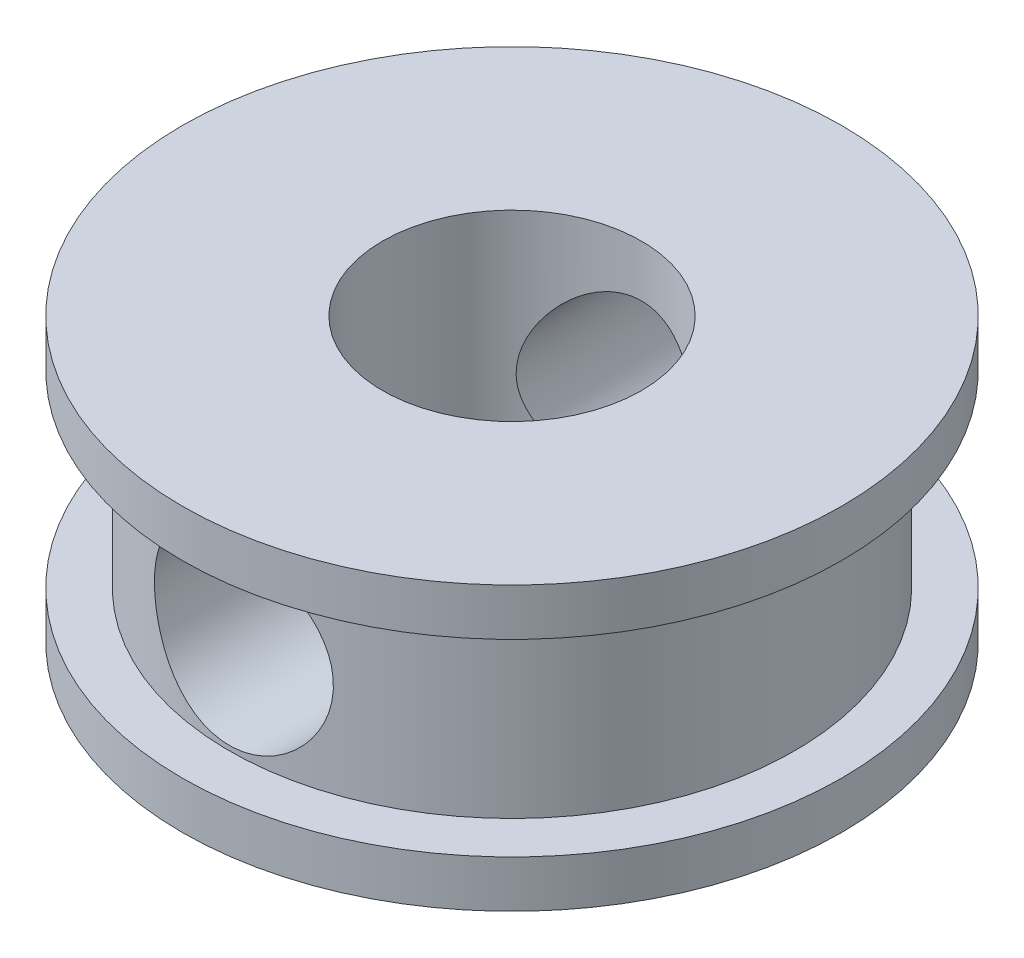
ISO-10303-21;
HEADER;
FILE_DESCRIPTION(('STEP AP214'),'2;1');
FILE_NAME('part.step','',(''),(''),'','','');
FILE_SCHEMA(('AUTOMOTIVE_DESIGN { 1 0 10303 214 1 1 1 1 }'));
ENDSEC;
DATA;
#1=APPLICATION_CONTEXT('core data for automotive mechanical design processes');
#2=APPLICATION_PROTOCOL_DEFINITION('international standard','automotive_design',2000,#1);
#3=PRODUCT_CONTEXT('',#1,'mechanical');
#4=PRODUCT('Part','Part','',(#3));
#5=PRODUCT_RELATED_PRODUCT_CATEGORY('part','',(#4));
#6=PRODUCT_DEFINITION_FORMATION('','',#4);
#7=PRODUCT_DEFINITION_CONTEXT('part definition',#1,'design');
#8=PRODUCT_DEFINITION('design','',#6,#7);
#9=PRODUCT_DEFINITION_SHAPE('','',#8);
#10=(LENGTH_UNIT() NAMED_UNIT(*) SI_UNIT(.MILLI.,.METRE.));
#11=(NAMED_UNIT(*) PLANE_ANGLE_UNIT() SI_UNIT($,.RADIAN.));
#12=(NAMED_UNIT(*) SI_UNIT($,.STERADIAN.) SOLID_ANGLE_UNIT());
#13=UNCERTAINTY_MEASURE_WITH_UNIT(LENGTH_MEASURE(1.E-05),#10,'distance_accuracy_value','');
#14=(GEOMETRIC_REPRESENTATION_CONTEXT(3) GLOBAL_UNCERTAINTY_ASSIGNED_CONTEXT((#13)) GLOBAL_UNIT_ASSIGNED_CONTEXT((#10,
#11,#12)) REPRESENTATION_CONTEXT('',''));
#15=CARTESIAN_POINT('',(0.,0.,0.));
#16=DIRECTION('',(0.,0.,1.));
#17=DIRECTION('',(1.,0.,0.));
#18=AXIS2_PLACEMENT_3D('',#15,#16,#17);
#19=CARTESIAN_POINT('',(0.,0.263948497845831,7.));
#20=DIRECTION('',(0.,0.,-1.));
#21=DIRECTION('',(-1.,0.,0.));
#22=AXIS2_PLACEMENT_3D('',#19,#20,#21);
#23=CYLINDRICAL_SURFACE('',#22,1.9);
#24=CARTESIAN_POINT('',(-1.9,0.263948497845831,1.9880895352071));
#25=CARTESIAN_POINT('',(-1.89999404447335,0.172327274623304,1.9881007358091));
#26=CARTESIAN_POINT('',(-1.89331043095478,0.0806676956721706,1.99454851919246));
#27=CARTESIAN_POINT('',(-1.86718454433567,-0.0992848520991401,2.01901316827147));
#28=CARTESIAN_POINT('',(-1.8477148194555,-0.187570143778473,2.03705492443201));
#29=CARTESIAN_POINT('',(-1.79764822395918,-0.357532810370994,2.08135844670453));
#30=CARTESIAN_POINT('',(-1.76717168893409,-0.43927039161618,2.10753090427701));
#31=CARTESIAN_POINT('',(-1.69629004962271,-0.596300804667676,2.1649897551614));
#32=CARTESIAN_POINT('',(-1.65588380386001,-0.67159289418559,2.19627673627818));
#33=CARTESIAN_POINT('',(-1.55833534939751,-0.8275776033711,2.26678073800009));
#34=CARTESIAN_POINT('',(-1.49951705098337,-0.907020956619099,2.30644281847351));
#35=CARTESIAN_POINT('',(-1.3701912373373,-1.05602049565281,2.38554763008912));
#36=CARTESIAN_POINT('',(-1.29966993909942,-1.12556484148201,2.42499004523128));
#37=CARTESIAN_POINT('',(-1.1353428696475,-1.26389410793194,2.50663206416706));
#38=CARTESIAN_POINT('',(-1.03961668156345,-1.33076898774464,2.5482595773733));
#39=CARTESIAN_POINT('',(-0.834873886026067,-1.44682722920803,2.62245462488903));
#40=CARTESIAN_POINT('',(-0.725883584681896,-1.49604486793004,2.6550396846641));
#41=CARTESIAN_POINT('',(-0.527893576818452,-1.56340241200277,2.70023568538219));
#42=CARTESIAN_POINT('',(-0.441189716547137,-1.58631344875936,2.7158470473333));
#43=CARTESIAN_POINT('',(-0.264362199220955,-1.61971463830576,2.7387103619111));
#44=CARTESIAN_POINT('',(-0.174241287405689,-1.63021455269059,2.74596888409369));
#45=CARTESIAN_POINT('',(0.0070210861693405,-1.63820738400496,2.751488477009));
#46=CARTESIAN_POINT('',(0.0981641135163359,-1.6356764669934,2.74973306088341));
#47=CARTESIAN_POINT('',(0.278558099739324,-1.61770679361148,2.7373499872899));
#48=CARTESIAN_POINT('',(0.367808510628421,-1.60226434978799,2.72671979524152));
#49=CARTESIAN_POINT('',(0.540131500294353,-1.55977741856117,2.69782146601909));
#50=CARTESIAN_POINT('',(0.623294108849536,-1.53298165238458,2.67971727076547));
#51=CARTESIAN_POINT('',(0.783781504366972,-1.46901344969137,2.63724974270066));
#52=CARTESIAN_POINT('',(0.86110516079632,-1.4318390101764,2.61288520176677));
#53=CARTESIAN_POINT('',(1.01716281444061,-1.34362612434644,2.55646556742752));
#54=CARTESIAN_POINT('',(1.09507632312398,-1.29149828595894,2.52385357819457));
#55=CARTESIAN_POINT('',(1.24155566131306,-1.17729472540619,2.45511729918543));
#56=CARTESIAN_POINT('',(1.31011092676434,-1.11520793018117,2.41898911765389));
#57=CARTESIAN_POINT('',(1.44839673133206,-0.970493560750748,2.33924544353163));
#58=CARTESIAN_POINT('',(1.51624231647591,-0.88617230437207,2.29542409356357));
#59=CARTESIAN_POINT('',(1.63724529668559,-0.706193862777931,2.21074011560224));
#60=CARTESIAN_POINT('',(1.69040834726466,-0.610541062663486,2.16987635287474));
#61=CARTESIAN_POINT('',(1.76980335263511,-0.432425229945425,2.1052975649513));
#62=CARTESIAN_POINT('',(1.79942712896406,-0.352128044040473,2.07980819780315));
#63=CARTESIAN_POINT('',(1.8478841504136,-0.186333490911925,2.03687984217778));
#64=CARTESIAN_POINT('',(1.86673748526285,-0.100846136558163,2.01942587743323));
#65=CARTESIAN_POINT('',(1.89259780209309,0.0743078260328144,1.9952221287981));
#66=CARTESIAN_POINT('',(1.89949339359139,0.164005820133362,1.98857303154539));
#67=CARTESIAN_POINT('',(1.90045206396883,0.343531373357523,1.98765816377183));
#68=CARTESIAN_POINT('',(1.8945175097829,0.433358905528485,1.99339010916744));
#69=CARTESIAN_POINT('',(1.87192998217414,0.598517087583221,2.01458751496171));
#70=CARTESIAN_POINT('',(1.85673916299946,0.674236461630931,2.02871961228108));
#71=CARTESIAN_POINT('',(1.81784749779855,0.82186138459038,2.06364069553949));
#72=CARTESIAN_POINT('',(1.79413821718417,0.893763072126628,2.08443627713857));
#73=CARTESIAN_POINT('',(1.72623582969987,1.06528008403537,2.14134557276662));
#74=CARTESIAN_POINT('',(1.67764251638548,1.1622801658443,2.18009028368248));
#75=CARTESIAN_POINT('',(1.56579729890002,1.34554063472735,2.26176723458626));
#76=CARTESIAN_POINT('',(1.50251731547395,1.43177995654507,2.30470740358499));
#77=CARTESIAN_POINT('',(1.36118267936232,1.59396114644787,2.39095276469785));
#78=CARTESIAN_POINT('',(1.28289947395058,1.66970755347376,2.4342521222988));
#79=CARTESIAN_POINT('',(1.11318361160209,1.80755987271563,2.51638277840081));
#80=CARTESIAN_POINT('',(1.02177126419677,1.86968648520253,2.55522081413946));
#81=CARTESIAN_POINT('',(0.84351761005188,1.96895815816514,2.6188489031262));
#82=CARTESIAN_POINT('',(0.758493921265446,2.00854752329301,2.64490306203371));
#83=CARTESIAN_POINT('',(0.581742290843918,2.07515696390105,2.68930418185455));
#84=CARTESIAN_POINT('',(0.490018578065371,2.10218488980771,2.70765595577135));
#85=CARTESIAN_POINT('',(0.301661107366574,2.14232931154243,2.73506794223266));
#86=CARTESIAN_POINT('',(0.205003862780601,2.15537117351322,2.74407829774714));
#87=CARTESIAN_POINT('',(0.0104289537572864,2.16641415840757,2.75170087443263));
#88=CARTESIAN_POINT('',(-0.0874883104226732,2.1644199454219,2.75031632003636));
#89=CARTESIAN_POINT('',(-0.272425141329088,2.14640391884695,2.73790145915056));
#90=CARTESIAN_POINT('',(-0.359633986981735,2.13165727458145,2.72774810007453));
#91=CARTESIAN_POINT('',(-0.530003719567272,2.09063341328941,2.69982453905535));
#92=CARTESIAN_POINT('',(-0.613163794347667,2.06435389335656,2.68205281587936));
#93=CARTESIAN_POINT('',(-0.777101251404958,2.00009180782719,2.63933569947019));
#94=CARTESIAN_POINT('',(-0.857631544608729,1.96166374552543,2.61412016646644));
#95=CARTESIAN_POINT('',(-1.01122151641791,1.8749170126742,2.55863424898025));
#96=CARTESIAN_POINT('',(-1.08427960123251,1.82659623862072,2.52836278970024));
#97=CARTESIAN_POINT('',(-1.23309342505974,1.71293982928929,2.45961505997743));
#98=CARTESIAN_POINT('',(-1.30746715660478,1.64612349207042,2.42059710067019));
#99=CARTESIAN_POINT('',(-1.44472140202148,1.50197544344435,2.34127839156583));
#100=CARTESIAN_POINT('',(-1.50757627472646,1.42462092496104,2.30097500884138));
#101=CARTESIAN_POINT('',(-1.62923008921627,1.24819237998192,2.2168276573934));
#102=CARTESIAN_POINT('',(-1.68608672491539,1.14759661005335,2.17332966490433));
#103=CARTESIAN_POINT('',(-1.78142084745983,0.934775214786165,2.09590809264525));
#104=CARTESIAN_POINT('',(-1.81996617810101,0.822594423972913,2.0619493639706));
#105=CARTESIAN_POINT('',(-1.8649316727826,0.634648571886548,2.02115440191293));
#106=CARTESIAN_POINT('',(-1.87801365715203,0.561642900267123,2.00890691487569));
#107=CARTESIAN_POINT('',(-1.89554555552317,0.413748104809042,1.99237423770124));
#108=CARTESIAN_POINT('',(-1.90000486944089,0.338861122215056,1.98808037721444));
#109=CARTESIAN_POINT('',(-1.9,0.263948497845831,1.9880895352071));
#110=B_SPLINE_CURVE_WITH_KNOTS('',3,(#24,#25,#26,#27,#28,#29,#30,#31,#32,#33,#34,#35,#36,#37,
#38,#39,#40,#41,#42,#43,#44,#45,#46,#47,#48,#49,#50,#51,#52,#53,#54,#55,#56,#57,#58,#59,#60,#61,
#62,#63,#64,#65,#66,#67,#68,#69,#70,#71,#72,#73,#74,#75,#76,#77,#78,#79,#80,#81,#82,#83,#84,#85,
#86,#87,#88,#89,#90,#91,#92,#93,#94,#95,#96,#97,#98,#99,#100,#101,#102,#103,#104,#105,#106,#107,
#108,#109),.UNSPECIFIED.,.T.,.F.,(4,2,2,2,2,2,2,2,2,2,2,2,2,2,2,2,2,2,2,2,2,2,2,2,2,2,2,2,2,2,2,
2,2,2,2,2,2,2,2,2,2,2,4),(0.,0.274508679357424,0.549608664145362,0.821787815995563,
1.09399827102662,1.41236862523757,1.73111663087082,2.1009777344836,2.47011691078032,
2.74202808525158,3.0137252535594,3.28591954380634,3.55819159764206,3.8247844348667,
4.09142875791803,4.38807931109034,4.68506201689974,5.03390101476297,5.38260545657429,
5.64955108576142,5.91599715102041,6.18491218096212,6.45377760507088,6.68838286250651,
6.92322105835044,7.26698939937799,7.61142048115729,7.96158898121834,8.31122152425245,
8.60204188948669,8.8926802577283,9.1848619583122,9.47695302979882,9.74282631526377,
10.0087527149802,10.2858571501807,10.5630205678747,10.8837633573077,11.2052116755666,
11.5737393718898,11.9408908053286,12.165583511158,12.3900311321294),.UNSPECIFIED.);
#111=CARTESIAN_POINT('',(-1.9,0.263948497845831,1.9880895352071));
#112=VERTEX_POINT('',#111);
#113=EDGE_CURVE('E35',#112,#112,#110,.T.);
#114=ORIENTED_EDGE('',*,*,#113,.F.);
#115=EDGE_LOOP('',(#114));
#116=FACE_BOUND('',#115,.T.);
#117=CARTESIAN_POINT('',(-1.9,0.263948497845831,5.69122131005288));
#118=CARTESIAN_POINT('',(-1.89999951461097,0.160138389615826,5.69122178108922));
#119=CARTESIAN_POINT('',(-1.89146334205856,0.0563230991486301,5.69409268675618));
#120=CARTESIAN_POINT('',(-1.85764525072656,-0.14825250031292,5.70521364105908));
#121=CARTESIAN_POINT('',(-1.8323591626832,-0.24901204216127,5.71346502895647));
#122=CARTESIAN_POINT('',(-1.76600189837454,-0.44448266667213,5.73432068347723));
#123=CARTESIAN_POINT('',(-1.7249592338161,-0.539204316052674,5.74691708359616));
#124=CARTESIAN_POINT('',(-1.62834946233828,-0.720444712950208,5.77503243837614));
#125=CARTESIAN_POINT('',(-1.57277966002639,-0.80696193413827,5.79055193524455));
#126=CARTESIAN_POINT('',(-1.44659335510361,-0.972389924890978,5.82337893060456));
#127=CARTESIAN_POINT('',(-1.37555227841406,-1.05096871364721,5.84072775201759));
#128=CARTESIAN_POINT('',(-1.22134806077992,-1.19532041074343,5.87490746875288));
#129=CARTESIAN_POINT('',(-1.13818318248352,-1.26109148056511,5.8917382894258));
#130=CARTESIAN_POINT('',(-0.959698253771898,-1.37943373810394,5.923459432749));
#131=CARTESIAN_POINT('',(-0.864140245402958,-1.43166187457606,5.93829544010384));
#132=CARTESIAN_POINT('',(-0.665046318915529,-1.51917487280831,5.96387194499015));
#133=CARTESIAN_POINT('',(-0.561512336237103,-1.5544638300737,5.97461343235326));
#134=CARTESIAN_POINT('',(-0.352882356507178,-1.60598491269896,5.99049809277132));
#135=CARTESIAN_POINT('',(-0.24793944505817,-1.62278470338577,5.99580765340763));
#136=CARTESIAN_POINT('',(-0.0365990474902378,-1.63865041211895,6.00081844941989));
#137=CARTESIAN_POINT('',(0.0697980935770898,-1.63772046641487,6.00052099288218));
#138=CARTESIAN_POINT('',(0.2770270095793,-1.61852392561062,5.99446652110423));
#139=CARTESIAN_POINT('',(0.377922384104364,-1.6008729345324,5.98890337415211));
#140=CARTESIAN_POINT('',(0.575237240108323,-1.54974698983132,5.97318200978825));
#141=CARTESIAN_POINT('',(0.67165642667004,-1.51627099518595,5.96302349007917));
#142=CARTESIAN_POINT('',(0.858687697049106,-1.43405691867455,5.93899518037538));
#143=CARTESIAN_POINT('',(0.949212710053508,-1.38513431659119,5.92508083250457));
#144=CARTESIAN_POINT('',(1.12095802696948,-1.27356453950547,5.89500347880482));
#145=CARTESIAN_POINT('',(1.20217592187602,-1.21091382335611,5.87883989318159));
#146=CARTESIAN_POINT('',(1.35667080955388,-1.07051691461934,5.84516603040151));
#147=CARTESIAN_POINT('',(1.42946009284107,-0.992240016025448,5.82762772168522));
#148=CARTESIAN_POINT('',(1.56102634121704,-0.82442923558502,5.79377455562653));
#149=CARTESIAN_POINT('',(1.61980156222284,-0.734893954721952,5.7774598507375));
#150=CARTESIAN_POINT('',(1.72225929429776,-0.545697560671911,5.74775728000804));
#151=CARTESIAN_POINT('',(1.76575631043876,-0.445929810489086,5.73440606520027));
#152=CARTESIAN_POINT('',(1.83517704757589,-0.239960225635506,5.71257078385741));
#153=CARTESIAN_POINT('',(1.8611072843571,-0.133760792513788,5.70408491287214));
#154=CARTESIAN_POINT('',(1.89370738372199,0.0773746262815645,5.69334318128997));
#155=CARTESIAN_POINT('',(1.90112592774583,0.182182761884772,5.69084531691173));
#156=CARTESIAN_POINT('',(1.89859756362179,0.391555158188342,5.69168961115461));
#157=CARTESIAN_POINT('',(1.88865342762767,0.496119455151346,5.69503083749706));
#158=CARTESIAN_POINT('',(1.85235181752677,0.698777659677512,5.70693744907749));
#159=CARTESIAN_POINT('',(1.82649480961419,0.796971560563028,5.71534338425498));
#160=CARTESIAN_POINT('',(1.75969154254167,0.987614517231015,5.73626206903329));
#161=CARTESIAN_POINT('',(1.71874277909903,1.0800626165946,5.74877550018252));
#162=CARTESIAN_POINT('',(1.62155071181386,1.25958716303634,5.77695401924649));
#163=CARTESIAN_POINT('',(1.56489456265195,1.34642696420155,5.79270068355325));
#164=CARTESIAN_POINT('',(1.43837516008311,1.50963904926588,5.82540462536309));
#165=CARTESIAN_POINT('',(1.3685083844655,1.58600853218482,5.84236222497303));
#166=CARTESIAN_POINT('',(1.2140011176404,1.72947950016837,5.87645403786366));
#167=CARTESIAN_POINT('',(1.12885693507396,1.79604556560467,5.89356483909657));
#168=CARTESIAN_POINT('',(0.948191338146899,1.91396872381165,5.92531287720672));
#169=CARTESIAN_POINT('',(0.852670382240863,1.96532648812465,5.93995022329033));
#170=CARTESIAN_POINT('',(0.65453247290351,2.05088532013046,5.96502101737351));
#171=CARTESIAN_POINT('',(0.551972313338818,2.08520870694505,5.97548432810487));
#172=CARTESIAN_POINT('',(0.342144058784668,2.13600061221426,5.99115914139615));
#173=CARTESIAN_POINT('',(0.2348774922949,2.15247488351464,5.99637233605257));
#174=CARTESIAN_POINT('',(0.0236036136677611,2.16662356978403,6.00084434499409));
#175=CARTESIAN_POINT('',(-0.080347395367981,2.16507039227504,6.00034780829014));
#176=CARTESIAN_POINT('',(-0.286439920096506,2.14508347801277,5.99404534291335));
#177=CARTESIAN_POINT('',(-0.38858155871845,2.1266508925699,5.98823977635878));
#178=CARTESIAN_POINT('',(-0.586833571257674,2.07392455892514,5.97205147229265));
#179=CARTESIAN_POINT('',(-0.683005553843192,2.03984237763534,5.96172987212882));
#180=CARTESIAN_POINT('',(-0.868310904661838,1.95697624404847,5.93757335329252));
#181=CARTESIAN_POINT('',(-0.957443047167143,1.90818973862753,5.92373782455943));
#182=CARTESIAN_POINT('',(-1.1294900736179,1.79535244759686,5.89339885823555));
#183=CARTESIAN_POINT('',(-1.21208383290232,1.7308325934896,5.87681977081111));
#184=CARTESIAN_POINT('',(-1.36552782359028,1.58918154716722,5.84307434798147));
#185=CARTESIAN_POINT('',(-1.43637448262752,1.51204653271692,5.8259078358444));
#186=CARTESIAN_POINT('',(-1.56676811363725,1.34418617240301,5.79223058238442));
#187=CARTESIAN_POINT('',(-1.62584435977711,1.25308553143492,5.77576250710756));
#188=CARTESIAN_POINT('',(-1.7277880398124,1.06175011334209,5.74609280075954));
#189=CARTESIAN_POINT('',(-1.77066159325797,0.961518802541238,5.73288993711208));
#190=CARTESIAN_POINT('',(-1.8361078037552,0.762741549246327,5.71224970609238));
#191=CARTESIAN_POINT('',(-1.85999545550202,0.664666178391748,5.70444503456281));
#192=CARTESIAN_POINT('',(-1.8919397019966,0.465711171262344,5.69393127956345));
#193=CARTESIAN_POINT('',(-1.9000004717063,0.36483228164852,5.69122085229467));
#194=CARTESIAN_POINT('',(-1.9,0.263948497845831,5.69122131005288));
#195=B_SPLINE_CURVE_WITH_KNOTS('',3,(#117,#118,#119,#120,#121,#122,#123,#124,#125,#126,#127,
#128,#129,#130,#131,#132,#133,#134,#135,#136,#137,#138,#139,#140,#141,#142,#143,#144,#145,#146,
#147,#148,#149,#150,#151,#152,#153,#154,#155,#156,#157,#158,#159,#160,#161,#162,#163,#164,#165,
#166,#167,#168,#169,#170,#171,#172,#173,#174,#175,#176,#177,#178,#179,#180,#181,#182,#183,#184,
#185,#186,#187,#188,#189,#190,#191,#192,#193,#194),.UNSPECIFIED.,.T.,.F.,(4,2,2,2,2,2,2,2,2,2,2,
2,2,2,2,2,2,2,2,2,2,2,2,2,2,2,2,2,2,2,2,2,2,2,2,2,2,2,4),(0.,0.311057485563659,0.62219242634023,
0.932766998488598,1.24339923617764,1.56397124985508,1.88458924703363,2.21267345515481,
2.54067830003071,2.85830439754681,3.17585639555598,3.48215389162301,3.78847153978468,
4.09859639106658,4.40880133297061,4.7322634749321,5.05576585153068,5.38307018484699,
5.71025304945257,6.0239718559345,6.3376405781413,6.64191553431825,6.94624100375948,7.2594801271,
7.57280288416476,7.89951310211596,8.22620889160036,8.55052354334126,8.87473363596869,
9.18510571682711,9.4954566294079,9.8017301258449,10.1080568314656,10.4249651722215,
10.7419697107191,11.069843506358,11.397593344198,11.6999621388886,12.0022511612089),.UNSPECIFIED.);
#196=CARTESIAN_POINT('',(-1.9,0.263948497845831,5.69122131005288));
#197=VERTEX_POINT('',#196);
#198=EDGE_CURVE('E58',#197,#197,#195,.T.);
#199=ORIENTED_EDGE('',*,*,#198,.T.);
#200=EDGE_LOOP('',(#199));
#201=FACE_BOUND('',#200,.T.);
#202=ADVANCED_FACE('F31',(#116,#201),#23,.F.);
#203=CARTESIAN_POINT('',(0.,3.26394849784583,0.));
#204=DIRECTION('',(0.,1.,0.));
#205=DIRECTION('',(-1.,0.,0.));
#206=AXIS2_PLACEMENT_3D('',#203,#204,#205);
#207=CYLINDRICAL_SURFACE('',#206,6.);
#208=CARTESIAN_POINT('',(0.,2.26394849784583,0.));
#209=DIRECTION('',(0.,1.,0.));
#210=DIRECTION('',(-1.,0.,0.));
#211=AXIS2_PLACEMENT_3D('',#208,#209,#210);
#212=CIRCLE('',#211,6.);
#213=CARTESIAN_POINT('',(-6.,2.26394849784583,0.));
#214=VERTEX_POINT('',#213);
#215=EDGE_CURVE('E99',#214,#214,#212,.T.);
#216=ORIENTED_EDGE('',*,*,#215,.F.);
#217=EDGE_LOOP('',(#216));
#218=FACE_BOUND('',#217,.T.);
#219=CARTESIAN_POINT('',(0.,-1.73605150215417,0.));
#220=DIRECTION('',(0.,1.,0.));
#221=DIRECTION('',(-1.,0.,0.));
#222=AXIS2_PLACEMENT_3D('',#219,#220,#221);
#223=CIRCLE('',#222,6.);
#224=CARTESIAN_POINT('',(-6.,-1.73605150215417,0.));
#225=VERTEX_POINT('',#224);
#226=EDGE_CURVE('E48',#225,#225,#223,.T.);
#227=ORIENTED_EDGE('',*,*,#226,.T.);
#228=EDGE_LOOP('',(#227));
#229=FACE_BOUND('',#228,.T.);
#230=CARTESIAN_POINT('',(-1.9,0.263948497845831,-5.69122131005288));
#231=CARTESIAN_POINT('',(-1.89999951461097,0.367758606075837,-5.69122178108922));
#232=CARTESIAN_POINT('',(-1.89146334205856,0.471573896543033,-5.69409268675618));
#233=CARTESIAN_POINT('',(-1.85764525072656,0.676149496004583,-5.70521364105908));
#234=CARTESIAN_POINT('',(-1.8323591626832,0.776909037852932,-5.71346502895647));
#235=CARTESIAN_POINT('',(-1.76600189837454,0.972379662363792,-5.73432068347723));
#236=CARTESIAN_POINT('',(-1.7249592338161,1.06710131174434,-5.74691708359616));
#237=CARTESIAN_POINT('',(-1.62834946233828,1.24834170864187,-5.77503243837614));
#238=CARTESIAN_POINT('',(-1.57277966002639,1.33485892982993,-5.79055193524455));
#239=CARTESIAN_POINT('',(-1.44659335510361,1.50028692058264,-5.82337893060456));
#240=CARTESIAN_POINT('',(-1.37555227841406,1.57886570933887,-5.84072775201759));
#241=CARTESIAN_POINT('',(-1.22134806077992,1.72321740643509,-5.87490746875288));
#242=CARTESIAN_POINT('',(-1.13818318248352,1.78898847625677,-5.8917382894258));
#243=CARTESIAN_POINT('',(-0.959698253771898,1.9073307337956,-5.923459432749));
#244=CARTESIAN_POINT('',(-0.864140245402958,1.95955887026772,-5.93829544010384));
#245=CARTESIAN_POINT('',(-0.665046318915529,2.04707186849998,-5.96387194499015));
#246=CARTESIAN_POINT('',(-0.561512336237103,2.08236082576537,-5.97461343235326));
#247=CARTESIAN_POINT('',(-0.352882356507178,2.13388190839062,-5.99049809277132));
#248=CARTESIAN_POINT('',(-0.24793944505817,2.15068169907744,-5.99580765340763));
#249=CARTESIAN_POINT('',(-0.0365990474902378,2.16654740781062,-6.00081844941989));
#250=CARTESIAN_POINT('',(0.0697980935770897,2.16561746210654,-6.00052099288218));
#251=CARTESIAN_POINT('',(0.2770270095793,2.14642092130228,-5.99446652110423));
#252=CARTESIAN_POINT('',(0.377922384104364,2.12876993022406,-5.98890337415211));
#253=CARTESIAN_POINT('',(0.575237240108323,2.07764398552298,-5.97318200978825));
#254=CARTESIAN_POINT('',(0.67165642667004,2.04416799087761,-5.96302349007917));
#255=CARTESIAN_POINT('',(0.858687697049106,1.96195391436622,-5.93899518037538));
#256=CARTESIAN_POINT('',(0.949212710053508,1.91303131228285,-5.92508083250457));
#257=CARTESIAN_POINT('',(1.12095802696948,1.80146153519713,-5.89500347880482));
#258=CARTESIAN_POINT('',(1.20217592187602,1.73881081904778,-5.87883989318159));
#259=CARTESIAN_POINT('',(1.35667080955388,1.59841391031101,-5.84516603040151));
#260=CARTESIAN_POINT('',(1.42946009284107,1.52013701171711,-5.82762772168522));
#261=CARTESIAN_POINT('',(1.56102634121704,1.35232623127668,-5.79377455562653));
#262=CARTESIAN_POINT('',(1.61980156222284,1.26279095041362,-5.7774598507375));
#263=CARTESIAN_POINT('',(1.72225929429776,1.07359455636357,-5.74775728000804));
#264=CARTESIAN_POINT('',(1.76575631043876,0.973826806180749,-5.73440606520027));
#265=CARTESIAN_POINT('',(1.83517704757589,0.767857221327168,-5.71257078385741));
#266=CARTESIAN_POINT('',(1.8611072843571,0.661657788205451,-5.70408491287214));
#267=CARTESIAN_POINT('',(1.89370738372199,0.450522369410098,-5.69334318128997));
#268=CARTESIAN_POINT('',(1.90112592774583,0.345714233806891,-5.69084531691173));
#269=CARTESIAN_POINT('',(1.89859756362179,0.136341837503321,-5.69168961115461));
#270=CARTESIAN_POINT('',(1.88865342762767,0.0317775405403169,-5.69503083749706));
#271=CARTESIAN_POINT('',(1.85235181752677,-0.170880663985849,-5.70693744907749));
#272=CARTESIAN_POINT('',(1.8264948096142,-0.269074564871365,-5.71534338425498));
#273=CARTESIAN_POINT('',(1.75969154254167,-0.459717521539352,-5.73626206903329));
#274=CARTESIAN_POINT('',(1.71874277909903,-0.55216562090294,-5.74877550018252));
#275=CARTESIAN_POINT('',(1.62155071181386,-0.731690167344681,-5.77695401924649));
#276=CARTESIAN_POINT('',(1.56489456265195,-0.818529968509891,-5.79270068355325));
#277=CARTESIAN_POINT('',(1.43837516008311,-0.98174205357422,-5.82540462536309));
#278=CARTESIAN_POINT('',(1.3685083844655,-1.05811153649316,-5.84236222497303));
#279=CARTESIAN_POINT('',(1.2140011176404,-1.20158250447671,-5.87645403786366));
#280=CARTESIAN_POINT('',(1.12885693507396,-1.26814856991301,-5.89356483909657));
#281=CARTESIAN_POINT('',(0.948191338146899,-1.38607172811998,-5.92531287720672));
#282=CARTESIAN_POINT('',(0.852670382240863,-1.43742949243299,-5.93995022329033));
#283=CARTESIAN_POINT('',(0.65453247290351,-1.52298832443879,-5.96502101737351));
#284=CARTESIAN_POINT('',(0.551972313338819,-1.55731171125339,-5.97548432810487));
#285=CARTESIAN_POINT('',(0.342144058784668,-1.6081036165226,-5.99115914139615));
#286=CARTESIAN_POINT('',(0.2348774922949,-1.62457788782297,-5.99637233605257));
#287=CARTESIAN_POINT('',(0.0236036136677613,-1.63872657409236,-6.00084434499409));
#288=CARTESIAN_POINT('',(-0.0803473953679809,-1.63717339658337,-6.00034780829014));
#289=CARTESIAN_POINT('',(-0.286439920096506,-1.61718648232111,-5.99404534291335));
#290=CARTESIAN_POINT('',(-0.388581558718449,-1.59875389687824,-5.98823977635878));
#291=CARTESIAN_POINT('',(-0.586833571257674,-1.54602756323347,-5.97205147229265));
#292=CARTESIAN_POINT('',(-0.683005553843193,-1.51194538194368,-5.96172987212882));
#293=CARTESIAN_POINT('',(-0.868310904661839,-1.42907924835681,-5.93757335329252));
#294=CARTESIAN_POINT('',(-0.957443047167144,-1.38029274293586,-5.92373782455943));
#295=CARTESIAN_POINT('',(-1.1294900736179,-1.2674554519052,-5.89339885823555));
#296=CARTESIAN_POINT('',(-1.21208383290232,-1.20293559779793,-5.87681977081111));
#297=CARTESIAN_POINT('',(-1.36552782359028,-1.06128455147555,-5.84307434798147));
#298=CARTESIAN_POINT('',(-1.43637448262752,-0.984149537025262,-5.8259078358444));
#299=CARTESIAN_POINT('',(-1.56676811363725,-0.816289176711345,-5.79223058238442));
#300=CARTESIAN_POINT('',(-1.62584435977711,-0.725188535743258,-5.77576250710756));
#301=CARTESIAN_POINT('',(-1.7277880398124,-0.533853117650432,-5.74609280075954));
#302=CARTESIAN_POINT('',(-1.77066159325797,-0.433621806849576,-5.73288993711208));
#303=CARTESIAN_POINT('',(-1.8361078037552,-0.234844553554665,-5.71224970609238));
#304=CARTESIAN_POINT('',(-1.85999545550202,-0.136769182700086,-5.70444503456281));
#305=CARTESIAN_POINT('',(-1.8919397019966,0.062185824429318,-5.69393127956345));
#306=CARTESIAN_POINT('',(-1.9000004717063,0.163064714043142,-5.69122085229467));
#307=CARTESIAN_POINT('',(-1.9,0.263948497845831,-5.69122131005288));
#308=B_SPLINE_CURVE_WITH_KNOTS('',3,(#230,#231,#232,#233,#234,#235,#236,#237,#238,#239,#240,
#241,#242,#243,#244,#245,#246,#247,#248,#249,#250,#251,#252,#253,#254,#255,#256,#257,#258,#259,
#260,#261,#262,#263,#264,#265,#266,#267,#268,#269,#270,#271,#272,#273,#274,#275,#276,#277,#278,
#279,#280,#281,#282,#283,#284,#285,#286,#287,#288,#289,#290,#291,#292,#293,#294,#295,#296,#297,
#298,#299,#300,#301,#302,#303,#304,#305,#306,#307),.UNSPECIFIED.,.T.,.F.,(4,2,2,2,2,2,2,2,2,2,2,
2,2,2,2,2,2,2,2,2,2,2,2,2,2,2,2,2,2,2,2,2,2,2,2,2,2,2,4),(0.,0.311057485563659,0.62219242634023,
0.932766998488598,1.24339923617764,1.56397124985508,1.88458924703363,2.21267345515481,
2.54067830003071,2.85830439754681,3.17585639555598,3.48215389162301,3.78847153978468,
4.09859639106658,4.40880133297061,4.7322634749321,5.05576585153068,5.38307018484699,
5.71025304945257,6.0239718559345,6.3376405781413,6.64191553431826,6.94624100375948,7.2594801271,
7.57280288416476,7.89951310211596,8.22620889160036,8.55052354334126,8.87473363596869,
9.18510571682711,9.4954566294079,9.8017301258449,10.1080568314656,10.4249651722215,
10.7419697107191,11.069843506358,11.397593344198,11.6999621388886,12.0022511612089),.UNSPECIFIED.);
#309=CARTESIAN_POINT('',(-1.9,0.263948497845831,-5.69122131005288));
#310=VERTEX_POINT('',#309);
#311=EDGE_CURVE('E52',#310,#310,#308,.T.);
#312=ORIENTED_EDGE('',*,*,#311,.F.);
#313=EDGE_LOOP('',(#312));
#314=FACE_BOUND('',#313,.T.);
#315=ORIENTED_EDGE('',*,*,#198,.F.);
#316=EDGE_LOOP('',(#315));
#317=FACE_BOUND('',#316,.T.);
#318=ADVANCED_FACE('F62',(#218,#229,#314,#317),#207,.T.);
#319=CARTESIAN_POINT('',(0.,-2.73605150215417,0.));
#320=DIRECTION('',(0.,1.,0.));
#321=DIRECTION('',(-1.,0.,0.));
#322=AXIS2_PLACEMENT_3D('',#319,#320,#321);
#323=PLANE('',#322);
#324=CARTESIAN_POINT('',(0.,-2.73605150215417,0.));
#325=DIRECTION('',(0.,1.,0.));
#326=DIRECTION('',(-1.,0.,0.));
#327=AXIS2_PLACEMENT_3D('',#324,#325,#326);
#328=CIRCLE('',#327,2.75);
#329=CARTESIAN_POINT('',(-2.75,-2.73605150215417,0.));
#330=VERTEX_POINT('',#329);
#331=EDGE_CURVE('E59',#330,#330,#328,.T.);
#332=ORIENTED_EDGE('',*,*,#331,.T.);
#333=EDGE_LOOP('',(#332));
#334=FACE_BOUND('',#333,.T.);
#335=CARTESIAN_POINT('',(0.,-2.73605150215417,0.));
#336=DIRECTION('',(0.,1.,0.));
#337=DIRECTION('',(-1.,0.,0.));
#338=AXIS2_PLACEMENT_3D('',#335,#336,#337);
#339=CIRCLE('',#338,7.);
#340=CARTESIAN_POINT('',(-7.,-2.73605150215417,0.));
#341=VERTEX_POINT('',#340);
#342=EDGE_CURVE('E10',#341,#341,#339,.T.);
#343=ORIENTED_EDGE('',*,*,#342,.F.);
#344=EDGE_LOOP('',(#343));
#345=FACE_BOUND('',#344,.T.);
#346=ADVANCED_FACE('F33',(#334,#345),#323,.F.);
#347=CARTESIAN_POINT('',(0.,3.26394849784583,0.));
#348=DIRECTION('',(0.,1.,0.));
#349=DIRECTION('',(-1.,0.,0.));
#350=AXIS2_PLACEMENT_3D('',#347,#348,#349);
#351=CYLINDRICAL_SURFACE('',#350,7.);
#352=CARTESIAN_POINT('',(0.,-1.73605150215417,0.));
#353=DIRECTION('',(0.,1.,0.));
#354=DIRECTION('',(-1.,0.,0.));
#355=AXIS2_PLACEMENT_3D('',#352,#353,#354);
#356=CIRCLE('',#355,7.);
#357=CARTESIAN_POINT('',(-7.,-1.73605150215417,0.));
#358=VERTEX_POINT('',#357);
#359=EDGE_CURVE('E43',#358,#358,#356,.T.);
#360=ORIENTED_EDGE('',*,*,#359,.F.);
#361=EDGE_LOOP('',(#360));
#362=FACE_BOUND('',#361,.T.);
#363=ORIENTED_EDGE('',*,*,#342,.T.);
#364=EDGE_LOOP('',(#363));
#365=FACE_BOUND('',#364,.T.);
#366=ADVANCED_FACE('F110',(#362,#365),#351,.T.);
#367=CARTESIAN_POINT('',(7.,-1.73605150215417,0.));
#368=DIRECTION('',(0.,-1.,0.));
#369=DIRECTION('',(1.,0.,0.));
#370=AXIS2_PLACEMENT_3D('',#367,#368,#369);
#371=PLANE('',#370);
#372=ORIENTED_EDGE('',*,*,#226,.F.);
#373=EDGE_LOOP('',(#372));
#374=FACE_BOUND('',#373,.T.);
#375=ORIENTED_EDGE('',*,*,#359,.T.);
#376=EDGE_LOOP('',(#375));
#377=FACE_BOUND('',#376,.T.);
#378=ADVANCED_FACE('F106',(#374,#377),#371,.F.);
#379=CARTESIAN_POINT('',(7.,2.26394849784583,0.));
#380=DIRECTION('',(0.,1.,0.));
#381=DIRECTION('',(-1.,0.,0.));
#382=AXIS2_PLACEMENT_3D('',#379,#380,#381);
#383=PLANE('',#382);
#384=CARTESIAN_POINT('',(0.,2.26394849784583,0.));
#385=DIRECTION('',(0.,1.,0.));
#386=DIRECTION('',(-1.,0.,0.));
#387=AXIS2_PLACEMENT_3D('',#384,#385,#386);
#388=CIRCLE('',#387,7.);
#389=CARTESIAN_POINT('',(-7.,2.26394849784583,0.));
#390=VERTEX_POINT('',#389);
#391=EDGE_CURVE('E96',#390,#390,#388,.T.);
#392=ORIENTED_EDGE('',*,*,#391,.F.);
#393=EDGE_LOOP('',(#392));
#394=FACE_BOUND('',#393,.T.);
#395=ORIENTED_EDGE('',*,*,#215,.T.);
#396=EDGE_LOOP('',(#395));
#397=FACE_BOUND('',#396,.T.);
#398=ADVANCED_FACE('F109',(#394,#397),#383,.F.);
#399=CARTESIAN_POINT('',(0.,3.26394849784583,0.));
#400=DIRECTION('',(0.,1.,0.));
#401=DIRECTION('',(-1.,0.,0.));
#402=AXIS2_PLACEMENT_3D('',#399,#400,#401);
#403=CYLINDRICAL_SURFACE('',#402,7.);
#404=CARTESIAN_POINT('',(0.,3.26394849784583,0.));
#405=DIRECTION('',(0.,1.,0.));
#406=DIRECTION('',(-1.,0.,0.));
#407=AXIS2_PLACEMENT_3D('',#404,#405,#406);
#408=CIRCLE('',#407,7.);
#409=CARTESIAN_POINT('',(-7.,3.26394849784583,0.));
#410=VERTEX_POINT('',#409);
#411=EDGE_CURVE('E93',#410,#410,#408,.T.);
#412=ORIENTED_EDGE('',*,*,#411,.F.);
#413=EDGE_LOOP('',(#412));
#414=FACE_BOUND('',#413,.T.);
#415=ORIENTED_EDGE('',*,*,#391,.T.);
#416=EDGE_LOOP('',(#415));
#417=FACE_BOUND('',#416,.T.);
#418=ADVANCED_FACE('F146',(#414,#417),#403,.T.);
#419=CARTESIAN_POINT('',(0.,3.26394849784583,0.));
#420=DIRECTION('',(0.,-1.,0.));
#421=DIRECTION('',(1.,0.,0.));
#422=AXIS2_PLACEMENT_3D('',#419,#420,#421);
#423=PLANE('',#422);
#424=CARTESIAN_POINT('',(0.,3.26394849784583,0.));
#425=DIRECTION('',(0.,1.,0.));
#426=DIRECTION('',(-1.,0.,0.));
#427=AXIS2_PLACEMENT_3D('',#424,#425,#426);
#428=CIRCLE('',#427,2.75);
#429=CARTESIAN_POINT('',(-2.75,3.26394849784583,0.));
#430=VERTEX_POINT('',#429);
#431=EDGE_CURVE('E82',#430,#430,#428,.T.);
#432=ORIENTED_EDGE('',*,*,#431,.F.);
#433=EDGE_LOOP('',(#432));
#434=FACE_BOUND('',#433,.T.);
#435=ORIENTED_EDGE('',*,*,#411,.T.);
#436=EDGE_LOOP('',(#435));
#437=FACE_BOUND('',#436,.T.);
#438=ADVANCED_FACE('F71',(#434,#437),#423,.F.);
#439=CARTESIAN_POINT('',(-1.9,0.263948497845831,-1.9880895352071));
#440=CARTESIAN_POINT('',(-1.89999404447335,0.355569721068359,-1.9881007358091));
#441=CARTESIAN_POINT('',(-1.89331043095478,0.447229300019492,-1.99454851919246));
#442=CARTESIAN_POINT('',(-1.86718454433567,0.627181847790803,-2.01901316827147));
#443=CARTESIAN_POINT('',(-1.8477148194555,0.715467139470136,-2.03705492443201));
#444=CARTESIAN_POINT('',(-1.79764822395918,0.885429806062657,-2.08135844670453));
#445=CARTESIAN_POINT('',(-1.76717168893409,0.967167387307843,-2.10753090427701));
#446=CARTESIAN_POINT('',(-1.69629004962271,1.12419780035934,-2.1649897551614));
#447=CARTESIAN_POINT('',(-1.65588380386001,1.19948988987725,-2.19627673627818));
#448=CARTESIAN_POINT('',(-1.55833534939751,1.35547459906276,-2.26678073800009));
#449=CARTESIAN_POINT('',(-1.49951705098337,1.43491795231076,-2.30644281847351));
#450=CARTESIAN_POINT('',(-1.3701912373373,1.58391749134448,-2.38554763008912));
#451=CARTESIAN_POINT('',(-1.29966993909942,1.65346183717368,-2.42499004523128));
#452=CARTESIAN_POINT('',(-1.1353428696475,1.7917911036236,-2.50663206416706));
#453=CARTESIAN_POINT('',(-1.03961668156345,1.8586659834363,-2.5482595773733));
#454=CARTESIAN_POINT('',(-0.834873886026067,1.97472422489969,-2.62245462488903));
#455=CARTESIAN_POINT('',(-0.725883584681896,2.0239418636217,-2.6550396846641));
#456=CARTESIAN_POINT('',(-0.527893576818451,2.09129940769444,-2.70023568538219));
#457=CARTESIAN_POINT('',(-0.441189716547137,2.11421044445102,-2.7158470473333));
#458=CARTESIAN_POINT('',(-0.264362199220955,2.14761163399742,-2.7387103619111));
#459=CARTESIAN_POINT('',(-0.174241287405689,2.15811154838225,-2.74596888409369));
#460=CARTESIAN_POINT('',(0.00702108616934137,2.16610437969662,-2.751488477009));
#461=CARTESIAN_POINT('',(0.098164113516337,2.16357346268507,-2.74973306088341));
#462=CARTESIAN_POINT('',(0.278558099739325,2.14560378930314,-2.7373499872899));
#463=CARTESIAN_POINT('',(0.367808510628422,2.13016134547965,-2.72671979524152));
#464=CARTESIAN_POINT('',(0.540131500294354,2.08767441425283,-2.69782146601909));
#465=CARTESIAN_POINT('',(0.623294108849537,2.06087864807624,-2.67971727076547));
#466=CARTESIAN_POINT('',(0.783781504366973,1.99691044538304,-2.63724974270066));
#467=CARTESIAN_POINT('',(0.861105160796321,1.95973600586806,-2.61288520176677));
#468=CARTESIAN_POINT('',(1.01716281444062,1.8715231200381,-2.55646556742752));
#469=CARTESIAN_POINT('',(1.09507632312398,1.8193952816506,-2.52385357819457));
#470=CARTESIAN_POINT('',(1.24155566131307,1.70519172109785,-2.45511729918543));
#471=CARTESIAN_POINT('',(1.31011092676434,1.64310492587283,-2.41898911765389));
#472=CARTESIAN_POINT('',(1.44839673133206,1.49839055644241,-2.33924544353163));
#473=CARTESIAN_POINT('',(1.51624231647591,1.41406930006373,-2.29542409356357));
#474=CARTESIAN_POINT('',(1.6372452966856,1.23409085846959,-2.21074011560224));
#475=CARTESIAN_POINT('',(1.69040834726466,1.13843805835515,-2.16987635287474));
#476=CARTESIAN_POINT('',(1.76980335263511,0.960322225637087,-2.1052975649513));
#477=CARTESIAN_POINT('',(1.79942712896406,0.880025039732135,-2.07980819780315));
#478=CARTESIAN_POINT('',(1.8478841504136,0.714230486603586,-2.03687984217778));
#479=CARTESIAN_POINT('',(1.86673748526285,0.628743132249825,-2.01942587743323));
#480=CARTESIAN_POINT('',(1.89259780209309,0.453589169658848,-1.9952221287981));
#481=CARTESIAN_POINT('',(1.89949339359139,0.3638911755583,-1.98857303154539));
#482=CARTESIAN_POINT('',(1.90045206396883,0.18436562233414,-1.98765816377183));
#483=CARTESIAN_POINT('',(1.8945175097829,0.0945380901631771,-1.99339010916744));
#484=CARTESIAN_POINT('',(1.87192998217414,-0.0706200918915588,-2.01458751496171));
#485=CARTESIAN_POINT('',(1.85673916299946,-0.146339465939269,-2.02871961228108));
#486=CARTESIAN_POINT('',(1.81784749779855,-0.293964388898718,-2.06364069553949));
#487=CARTESIAN_POINT('',(1.79413821718417,-0.365866076434965,-2.08443627713857));
#488=CARTESIAN_POINT('',(1.72623582969987,-0.537383088343711,-2.14134557276662));
#489=CARTESIAN_POINT('',(1.67764251638548,-0.634383170152637,-2.18009028368248));
#490=CARTESIAN_POINT('',(1.56579729890002,-0.81764363903569,-2.26176723458626));
#491=CARTESIAN_POINT('',(1.50251731547394,-0.903882960853408,-2.30470740358499));
#492=CARTESIAN_POINT('',(1.36118267936232,-1.06606415075621,-2.39095276469785));
#493=CARTESIAN_POINT('',(1.28289947395058,-1.14181055778209,-2.4342521222988));
#494=CARTESIAN_POINT('',(1.11318361160209,-1.27966287702397,-2.51638277840081));
#495=CARTESIAN_POINT('',(1.02177126419677,-1.34178948951087,-2.55522081413946));
#496=CARTESIAN_POINT('',(0.843517610051878,-1.44106116247348,-2.6188489031262));
#497=CARTESIAN_POINT('',(0.758493921265445,-1.48065052760135,-2.64490306203371));
#498=CARTESIAN_POINT('',(0.581742290843916,-1.54725996820939,-2.68930418185455));
#499=CARTESIAN_POINT('',(0.490018578065369,-1.57428789411604,-2.70765595577135));
#500=CARTESIAN_POINT('',(0.301661107366572,-1.61443231585077,-2.73506794223266));
#501=CARTESIAN_POINT('',(0.2050038627806,-1.62747417782156,-2.74407829774714));
#502=CARTESIAN_POINT('',(0.010428953757285,-1.6385171627159,-2.75170087443263));
#503=CARTESIAN_POINT('',(-0.0874883104226749,-1.63652294973024,-2.75031632003636));
#504=CARTESIAN_POINT('',(-0.272425141329089,-1.61850692315529,-2.73790145915056));
#505=CARTESIAN_POINT('',(-0.359633986981736,-1.60376027888978,-2.72774810007453));
#506=CARTESIAN_POINT('',(-0.530003719567273,-1.56273641759775,-2.69982453905535));
#507=CARTESIAN_POINT('',(-0.613163794347668,-1.5364568976649,-2.68205281587936));
#508=CARTESIAN_POINT('',(-0.777101251404961,-1.47219481213552,-2.63933569947019));
#509=CARTESIAN_POINT('',(-0.857631544608731,-1.43376674983377,-2.61412016646644));
#510=CARTESIAN_POINT('',(-1.01122151641791,-1.34702001698253,-2.55863424898025));
#511=CARTESIAN_POINT('',(-1.08427960123252,-1.29869924292905,-2.52836278970024));
#512=CARTESIAN_POINT('',(-1.23309342505975,-1.18504283359762,-2.45961505997743));
#513=CARTESIAN_POINT('',(-1.30746715660478,-1.11822649637876,-2.42059710067019));
#514=CARTESIAN_POINT('',(-1.44472140202148,-0.974078447752688,-2.34127839156583));
#515=CARTESIAN_POINT('',(-1.50757627472646,-0.896723929269375,-2.30097500884138));
#516=CARTESIAN_POINT('',(-1.62923008921627,-0.720295384290252,-2.2168276573934));
#517=CARTESIAN_POINT('',(-1.68608672491539,-0.619699614361687,-2.17332966490433));
#518=CARTESIAN_POINT('',(-1.78142084745983,-0.4068782190945,-2.09590809264525));
#519=CARTESIAN_POINT('',(-1.81996617810101,-0.294697428281248,-2.0619493639706));
#520=CARTESIAN_POINT('',(-1.8649316727826,-0.106751576194883,-2.02115440191293));
#521=CARTESIAN_POINT('',(-1.87801365715203,-0.0337459045754592,-2.00890691487569));
#522=CARTESIAN_POINT('',(-1.89554555552317,0.114148890882621,-1.99237423770124));
#523=CARTESIAN_POINT('',(-1.90000486944089,0.189035873476607,-1.98808037721444));
#524=CARTESIAN_POINT('',(-1.9,0.263948497845831,-1.9880895352071));
#525=B_SPLINE_CURVE_WITH_KNOTS('',3,(#439,#440,#441,#442,#443,#444,#445,#446,#447,#448,#449,
#450,#451,#452,#453,#454,#455,#456,#457,#458,#459,#460,#461,#462,#463,#464,#465,#466,#467,#468,
#469,#470,#471,#472,#473,#474,#475,#476,#477,#478,#479,#480,#481,#482,#483,#484,#485,#486,#487,
#488,#489,#490,#491,#492,#493,#494,#495,#496,#497,#498,#499,#500,#501,#502,#503,#504,#505,#506,
#507,#508,#509,#510,#511,#512,#513,#514,#515,#516,#517,#518,#519,#520,#521,#522,#523,#524),
.UNSPECIFIED.,.T.,.F.,(4,2,2,2,2,2,2,2,2,2,2,2,2,2,2,2,2,2,2,2,2,2,2,2,2,2,2,2,2,2,2,2,2,2,2,2,
2,2,2,2,2,2,4),(0.,0.274508679357424,0.549608664145362,0.821787815995563,1.09399827102662,
1.41236862523757,1.73111663087082,2.10097773448361,2.47011691078032,2.74202808525158,
3.0137252535594,3.28591954380635,3.55819159764206,3.8247844348667,4.09142875791803,
4.38807931109035,4.68506201689974,5.03390101476297,5.38260545657429,5.64955108576142,
5.91599715102041,6.18491218096212,6.45377760507088,6.68838286250651,6.92322105835045,
7.26698939937799,7.61142048115729,7.96158898121835,8.31122152425245,8.60204188948669,
8.89268025772831,9.1848619583122,9.47695302979883,9.74282631526377,10.0087527149802,
10.2858571501807,10.5630205678747,10.8837633573077,11.2052116755666,11.5737393718898,
11.9408908053286,12.165583511158,12.3900311321294),.UNSPECIFIED.);
#526=CARTESIAN_POINT('',(-1.9,0.263948497845831,-1.9880895352071));
#527=VERTEX_POINT('',#526);
#528=EDGE_CURVE('E78',#527,#527,#525,.T.);
#529=ORIENTED_EDGE('',*,*,#528,.F.);
#530=EDGE_LOOP('',(#529));
#531=FACE_BOUND('',#530,.T.);
#532=ORIENTED_EDGE('',*,*,#311,.T.);
#533=EDGE_LOOP('',(#532));
#534=FACE_BOUND('',#533,.T.);
#535=ADVANCED_FACE('F66',(#531,#534),#23,.F.);
#536=CARTESIAN_POINT('',(0.,-6.73605150215417,0.));
#537=DIRECTION('',(0.,1.,0.));
#538=DIRECTION('',(-1.,0.,0.));
#539=AXIS2_PLACEMENT_3D('',#536,#537,#538);
#540=CYLINDRICAL_SURFACE('',#539,2.75);
#541=ORIENTED_EDGE('',*,*,#431,.T.);
#542=EDGE_LOOP('',(#541));
#543=FACE_BOUND('',#542,.T.);
#544=ORIENTED_EDGE('',*,*,#528,.T.);
#545=EDGE_LOOP('',(#544));
#546=FACE_BOUND('',#545,.T.);
#547=ORIENTED_EDGE('',*,*,#113,.T.);
#548=EDGE_LOOP('',(#547));
#549=FACE_BOUND('',#548,.T.);
#550=ORIENTED_EDGE('',*,*,#331,.F.);
#551=EDGE_LOOP('',(#550));
#552=FACE_BOUND('',#551,.T.);
#553=ADVANCED_FACE('F70',(#543,#546,#549,#552),#540,.F.);
#554=CLOSED_SHELL('',(#202,#318,#346,#366,#378,#398,#418,#438,#535,#553));
#555=MANIFOLD_SOLID_BREP('B2',#554);
#556=ADVANCED_BREP_SHAPE_REPRESENTATION('',(#18,#555),#14);
#557=SHAPE_DEFINITION_REPRESENTATION(#9,#556);
ENDSEC;
END-ISO-10303-21;
